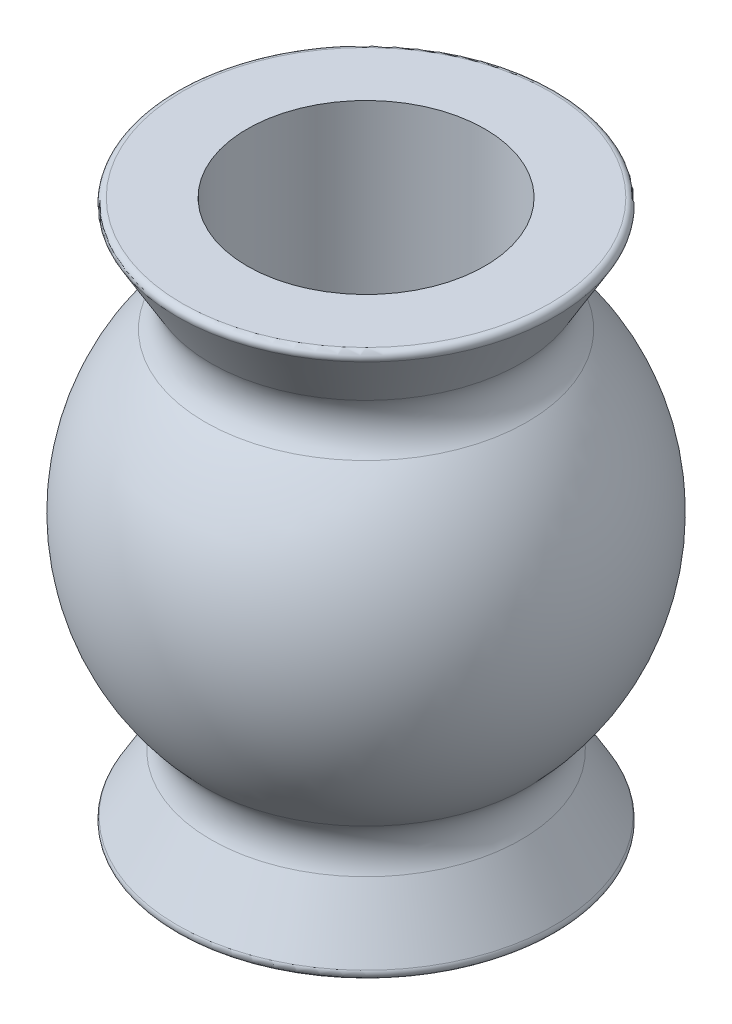
ISO-10303-21;
HEADER;
FILE_DESCRIPTION(('STEP AP214'),'2;1');
FILE_NAME('part.step','',(''),(''),'','','');
FILE_SCHEMA(('AUTOMOTIVE_DESIGN { 1 0 10303 214 1 1 1 1 }'));
ENDSEC;
DATA;
#1=APPLICATION_CONTEXT('core data for automotive mechanical design processes');
#2=APPLICATION_PROTOCOL_DEFINITION('international standard','automotive_design',2000,#1);
#3=PRODUCT_CONTEXT('',#1,'mechanical');
#4=PRODUCT('Part','Part','',(#3));
#5=PRODUCT_RELATED_PRODUCT_CATEGORY('part','',(#4));
#6=PRODUCT_DEFINITION_FORMATION('','',#4);
#7=PRODUCT_DEFINITION_CONTEXT('part definition',#1,'design');
#8=PRODUCT_DEFINITION('design','',#6,#7);
#9=PRODUCT_DEFINITION_SHAPE('','',#8);
#10=(LENGTH_UNIT() NAMED_UNIT(*) SI_UNIT(.MILLI.,.METRE.));
#11=(NAMED_UNIT(*) PLANE_ANGLE_UNIT() SI_UNIT($,.RADIAN.));
#12=(NAMED_UNIT(*) SI_UNIT($,.STERADIAN.) SOLID_ANGLE_UNIT());
#13=UNCERTAINTY_MEASURE_WITH_UNIT(LENGTH_MEASURE(1.E-05),#10,'distance_accuracy_value','');
#14=(GEOMETRIC_REPRESENTATION_CONTEXT(3) GLOBAL_UNCERTAINTY_ASSIGNED_CONTEXT((#13)) GLOBAL_UNIT_ASSIGNED_CONTEXT((#10,
#11,#12)) REPRESENTATION_CONTEXT('',''));
#15=CARTESIAN_POINT('',(0.,0.,0.));
#16=DIRECTION('',(0.,0.,1.));
#17=DIRECTION('',(1.,0.,0.));
#18=AXIS2_PLACEMENT_3D('',#15,#16,#17);
#19=CARTESIAN_POINT('',(2.4892,0.,0.));
#20=DIRECTION('',(0.,-1.,0.));
#21=DIRECTION('',(0.,0.,-1.));
#22=AXIS2_PLACEMENT_3D('',#19,#20,#21);
#23=PLANE('',#22);
#24=CARTESIAN_POINT('',(0.,0.,0.));
#25=DIRECTION('',(0.,-1.,0.));
#26=DIRECTION('',(0.,0.,-1.));
#27=AXIS2_PLACEMENT_3D('',#24,#25,#26);
#28=CIRCLE('',#27,2.35575927111134);
#29=CARTESIAN_POINT('',(0.,0.,-2.35575927111134));
#30=VERTEX_POINT('',#29);
#31=EDGE_CURVE('E53',#30,#30,#28,.T.);
#32=ORIENTED_EDGE('',*,*,#31,.T.);
#33=EDGE_LOOP('',(#32));
#34=FACE_BOUND('',#33,.T.);
#35=CARTESIAN_POINT('',(0.,0.,0.));
#36=DIRECTION('',(0.,-1.,0.));
#37=DIRECTION('',(0.,0.,-1.));
#38=AXIS2_PLACEMENT_3D('',#35,#36,#37);
#39=CIRCLE('',#38,1.524);
#40=CARTESIAN_POINT('',(0.,0.,-1.524));
#41=VERTEX_POINT('',#40);
#42=EDGE_CURVE('E70',#41,#41,#39,.T.);
#43=ORIENTED_EDGE('',*,*,#42,.F.);
#44=EDGE_LOOP('',(#43));
#45=FACE_BOUND('',#44,.T.);
#46=ADVANCED_FACE('F38',(#34,#45),#23,.T.);
#47=CARTESIAN_POINT('',(0.,0.,0.));
#48=DIRECTION('',(0.,-1.,0.));
#49=DIRECTION('',(0.,0.,-1.));
#50=AXIS2_PLACEMENT_3D('',#47,#48,#49);
#51=CYLINDRICAL_SURFACE('',#50,1.524);
#52=ORIENTED_EDGE('',*,*,#42,.T.);
#53=EDGE_LOOP('',(#52));
#54=FACE_BOUND('',#53,.T.);
#55=CARTESIAN_POINT('',(0.,6.985,0.));
#56=DIRECTION('',(0.,-1.,0.));
#57=DIRECTION('',(0.,0.,-1.));
#58=AXIS2_PLACEMENT_3D('',#55,#56,#57);
#59=CIRCLE('',#58,1.524);
#60=CARTESIAN_POINT('',(0.,6.985,-1.524));
#61=VERTEX_POINT('',#60);
#62=EDGE_CURVE('E73',#61,#61,#59,.T.);
#63=ORIENTED_EDGE('',*,*,#62,.F.);
#64=EDGE_LOOP('',(#63));
#65=FACE_BOUND('',#64,.T.);
#66=ADVANCED_FACE('F79',(#54,#65),#51,.F.);
#67=CARTESIAN_POINT('',(1.524,6.985,0.));
#68=DIRECTION('',(0.,1.,0.));
#69=DIRECTION('',(0.,0.,1.));
#70=AXIS2_PLACEMENT_3D('',#67,#68,#69);
#71=PLANE('',#70);
#72=CARTESIAN_POINT('',(0.,6.985,0.));
#73=DIRECTION('',(0.,1.,0.));
#74=DIRECTION('',(0.,0.,1.));
#75=AXIS2_PLACEMENT_3D('',#72,#73,#74);
#76=CIRCLE('',#75,2.35575927111134);
#77=CARTESIAN_POINT('',(0.,6.985,2.35575927111134));
#78=VERTEX_POINT('',#77);
#79=EDGE_CURVE('E10',#78,#78,#76,.T.);
#80=ORIENTED_EDGE('',*,*,#79,.T.);
#81=EDGE_LOOP('',(#80));
#82=FACE_BOUND('',#81,.T.);
#83=ORIENTED_EDGE('',*,*,#62,.T.);
#84=EDGE_LOOP('',(#83));
#85=FACE_BOUND('',#84,.T.);
#86=ADVANCED_FACE('F77',(#82,#85),#71,.T.);
#87=CARTESIAN_POINT('',(0.,5.7785,0.));
#88=DIRECTION('',(0.,1.,0.));
#89=DIRECTION('',(0.,0.,1.));
#90=AXIS2_PLACEMENT_3D('',#87,#88,#89);
#91=CONICAL_SURFACE('',#90,1.77727413754885,0.533089972720094);
#92=CARTESIAN_POINT('',(0.,6.87007539059065,0.));
#93=DIRECTION('',(0.,-1.,0.));
#94=DIRECTION('',(0.,0.,-1.));
#95=AXIS2_PLACEMENT_3D('',#92,#93,#94);
#96=CIRCLE('',#95,2.42138582538698);
#97=CARTESIAN_POINT('',(0.,6.87007539059065,-2.42138582538698));
#98=VERTEX_POINT('',#97);
#99=EDGE_CURVE('E45',#98,#98,#96,.T.);
#100=ORIENTED_EDGE('',*,*,#99,.T.);
#101=EDGE_LOOP('',(#100));
#102=FACE_BOUND('',#101,.T.);
#103=CARTESIAN_POINT('',(0.,6.1373710390865,0.));
#104=DIRECTION('',(0.,1.,0.));
#105=DIRECTION('',(0.,0.,1.));
#106=AXIS2_PLACEMENT_3D('',#103,#104,#105);
#107=CIRCLE('',#106,1.98903507746629);
#108=CARTESIAN_POINT('',(0.,6.1373710390865,1.98903507746629));
#109=VERTEX_POINT('',#108);
#110=EDGE_CURVE('E58',#109,#109,#107,.T.);
#111=ORIENTED_EDGE('',*,*,#110,.T.);
#112=EDGE_LOOP('',(#111));
#113=FACE_BOUND('',#112,.T.);
#114=ADVANCED_FACE('F87',(#102,#113),#91,.T.);
#115=CARTESIAN_POINT('',(0.,3.4925,0.));
#116=DIRECTION('',(0.,-1.,0.));
#117=DIRECTION('',(1.,0.,0.));
#118=AXIS2_PLACEMENT_3D('',#115,#116,#117);
#119=SPHERICAL_SURFACE('',#118,2.8956);
#120=CARTESIAN_POINT('',(0.,1.46201794548691,0.));
#121=DIRECTION('',(0.,1.,0.));
#122=DIRECTION('',(0.,0.,1.));
#123=AXIS2_PLACEMENT_3D('',#120,#121,#122);
#124=CIRCLE('',#123,2.06437447821375);
#125=CARTESIAN_POINT('',(0.,1.46201794548691,2.06437447821375));
#126=VERTEX_POINT('',#125);
#127=EDGE_CURVE('E61',#126,#126,#124,.T.);
#128=ORIENTED_EDGE('',*,*,#127,.T.);
#129=EDGE_LOOP('',(#128));
#130=FACE_BOUND('',#129,.T.);
#131=CARTESIAN_POINT('',(0.,5.52298205451309,0.));
#132=DIRECTION('',(0.,-1.,0.));
#133=DIRECTION('',(0.,0.,-1.));
#134=AXIS2_PLACEMENT_3D('',#131,#132,#133);
#135=CIRCLE('',#134,2.06437447821375);
#136=CARTESIAN_POINT('',(0.,5.52298205451309,-2.06437447821375));
#137=VERTEX_POINT('',#136);
#138=EDGE_CURVE('E64',#137,#137,#135,.T.);
#139=ORIENTED_EDGE('',*,*,#138,.T.);
#140=EDGE_LOOP('',(#139));
#141=FACE_BOUND('',#140,.T.);
#142=ADVANCED_FACE('F117',(#130,#141),#119,.T.);
#143=CARTESIAN_POINT('',(0.,0.,0.));
#144=DIRECTION('',(0.,-1.,0.));
#145=DIRECTION('',(0.,0.,-1.));
#146=AXIS2_PLACEMENT_3D('',#143,#144,#145);
#147=CONICAL_SURFACE('',#146,2.4892,0.533089972720094);
#148=CARTESIAN_POINT('',(0.,0.11492460940935,0.));
#149=DIRECTION('',(0.,1.,0.));
#150=DIRECTION('',(0.,0.,1.));
#151=AXIS2_PLACEMENT_3D('',#148,#149,#150);
#152=CIRCLE('',#151,2.42138582538698);
#153=CARTESIAN_POINT('',(0.,0.11492460940935,2.42138582538698));
#154=VERTEX_POINT('',#153);
#155=EDGE_CURVE('E49',#154,#154,#152,.T.);
#156=ORIENTED_EDGE('',*,*,#155,.T.);
#157=EDGE_LOOP('',(#156));
#158=FACE_BOUND('',#157,.T.);
#159=CARTESIAN_POINT('',(0.,0.847628960913503,0.));
#160=DIRECTION('',(0.,-1.,0.));
#161=DIRECTION('',(0.,0.,-1.));
#162=AXIS2_PLACEMENT_3D('',#159,#160,#161);
#163=CIRCLE('',#162,1.98903507746629);
#164=CARTESIAN_POINT('',(0.,0.847628960913503,-1.98903507746629));
#165=VERTEX_POINT('',#164);
#166=EDGE_CURVE('E67',#165,#165,#163,.T.);
#167=ORIENTED_EDGE('',*,*,#166,.T.);
#168=EDGE_LOOP('',(#167));
#169=FACE_BOUND('',#168,.T.);
#170=ADVANCED_FACE('F98',(#158,#169),#147,.T.);
#171=CARTESIAN_POINT('',(0.,1.1057930236425,0.));
#172=DIRECTION('',(0.,1.,0.));
#173=DIRECTION('',(0.,0.,1.));
#174=AXIS2_PLACEMENT_3D('',#171,#172,#173);
#175=TOROIDAL_SURFACE('',#174,2.42654543930388,0.508);
#176=ORIENTED_EDGE('',*,*,#127,.F.);
#177=EDGE_LOOP('',(#176));
#178=FACE_BOUND('',#177,.T.);
#179=ORIENTED_EDGE('',*,*,#166,.F.);
#180=EDGE_LOOP('',(#179));
#181=FACE_BOUND('',#180,.T.);
#182=ADVANCED_FACE('F94',(#178,#181),#175,.F.);
#183=CARTESIAN_POINT('',(0.,5.8792069763575,0.));
#184=DIRECTION('',(0.,-1.,0.));
#185=DIRECTION('',(0.,0.,-1.));
#186=AXIS2_PLACEMENT_3D('',#183,#184,#185);
#187=TOROIDAL_SURFACE('',#186,2.42654543930388,0.508);
#188=ORIENTED_EDGE('',*,*,#110,.F.);
#189=EDGE_LOOP('',(#188));
#190=FACE_BOUND('',#189,.T.);
#191=ORIENTED_EDGE('',*,*,#138,.F.);
#192=EDGE_LOOP('',(#191));
#193=FACE_BOUND('',#192,.T.);
#194=ADVANCED_FACE('F97',(#190,#193),#187,.F.);
#195=CARTESIAN_POINT('',(0.,0.0761999999999999,0.));
#196=DIRECTION('',(0.,-1.,0.));
#197=DIRECTION('',(0.,0.,-1.));
#198=AXIS2_PLACEMENT_3D('',#195,#196,#197);
#199=TOROIDAL_SURFACE('',#198,2.35575927111134,0.0762);
#200=ORIENTED_EDGE('',*,*,#155,.F.);
#201=EDGE_LOOP('',(#200));
#202=FACE_BOUND('',#201,.T.);
#203=ORIENTED_EDGE('',*,*,#31,.F.);
#204=EDGE_LOOP('',(#203));
#205=FACE_BOUND('',#204,.T.);
#206=ADVANCED_FACE('F101',(#202,#205),#199,.T.);
#207=CARTESIAN_POINT('',(0.,6.9088,0.));
#208=DIRECTION('',(0.,1.,0.));
#209=DIRECTION('',(0.,0.,1.));
#210=AXIS2_PLACEMENT_3D('',#207,#208,#209);
#211=TOROIDAL_SURFACE('',#210,2.35575927111134,0.0762);
#212=ORIENTED_EDGE('',*,*,#79,.F.);
#213=EDGE_LOOP('',(#212));
#214=FACE_BOUND('',#213,.T.);
#215=ORIENTED_EDGE('',*,*,#99,.F.);
#216=EDGE_LOOP('',(#215));
#217=FACE_BOUND('',#216,.T.);
#218=ADVANCED_FACE('F40',(#214,#217),#211,.T.);
#219=CLOSED_SHELL('',(#46,#66,#86,#114,#142,#170,#182,#194,#206,#218));
#220=MANIFOLD_SOLID_BREP('B2',#219);
#221=ADVANCED_BREP_SHAPE_REPRESENTATION('',(#18,#220),#14);
#222=SHAPE_DEFINITION_REPRESENTATION(#9,#221);
ENDSEC;
END-ISO-10303-21;
